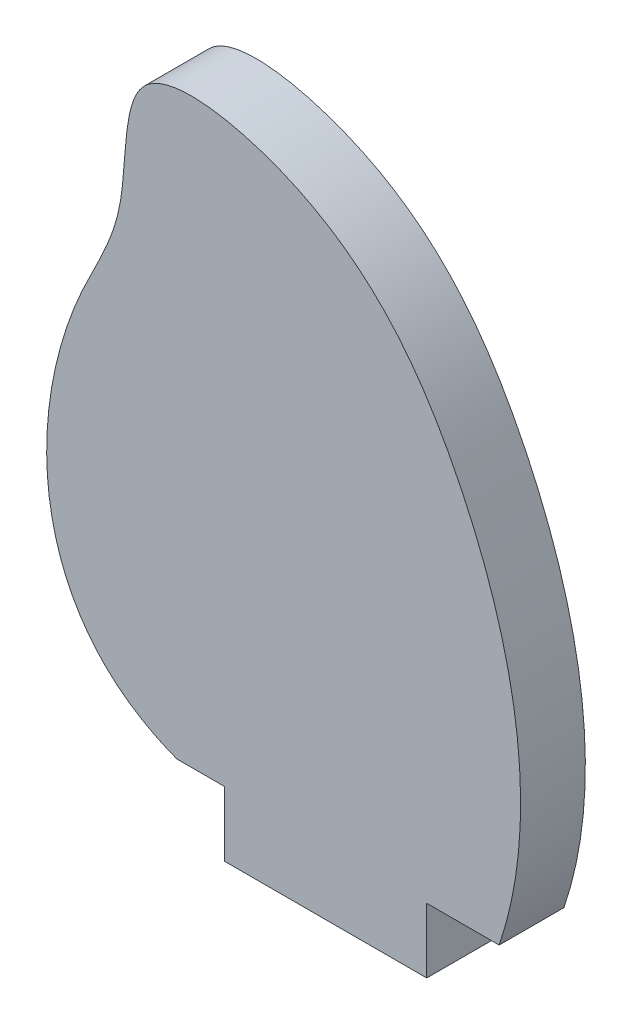
ISO-10303-21;
HEADER;
FILE_DESCRIPTION(('STEP AP214'),'2;1');
FILE_NAME('part.step','',(''),(''),'','','');
FILE_SCHEMA(('AUTOMOTIVE_DESIGN { 1 0 10303 214 1 1 1 1 }'));
ENDSEC;
DATA;
#1=APPLICATION_CONTEXT('core data for automotive mechanical design processes');
#2=APPLICATION_PROTOCOL_DEFINITION('international standard','automotive_design',2000,#1);
#3=PRODUCT_CONTEXT('',#1,'mechanical');
#4=PRODUCT('Part','Part','',(#3));
#5=PRODUCT_RELATED_PRODUCT_CATEGORY('part','',(#4));
#6=PRODUCT_DEFINITION_FORMATION('','',#4);
#7=PRODUCT_DEFINITION_CONTEXT('part definition',#1,'design');
#8=PRODUCT_DEFINITION('design','',#6,#7);
#9=PRODUCT_DEFINITION_SHAPE('','',#8);
#10=(LENGTH_UNIT() NAMED_UNIT(*) SI_UNIT(.MILLI.,.METRE.));
#11=(NAMED_UNIT(*) PLANE_ANGLE_UNIT() SI_UNIT($,.RADIAN.));
#12=(NAMED_UNIT(*) SI_UNIT($,.STERADIAN.) SOLID_ANGLE_UNIT());
#13=UNCERTAINTY_MEASURE_WITH_UNIT(LENGTH_MEASURE(1.E-05),#10,'distance_accuracy_value','');
#14=(GEOMETRIC_REPRESENTATION_CONTEXT(3) GLOBAL_UNCERTAINTY_ASSIGNED_CONTEXT((#13)) GLOBAL_UNIT_ASSIGNED_CONTEXT((#10,
#11,#12)) REPRESENTATION_CONTEXT('',''));
#15=CARTESIAN_POINT('',(0.,0.,0.));
#16=DIRECTION('',(0.,0.,1.));
#17=DIRECTION('',(1.,0.,0.));
#18=AXIS2_PLACEMENT_3D('',#15,#16,#17);
#19=CARTESIAN_POINT('',(0.,-3.2,3.2));
#20=DIRECTION('',(1.,0.,0.));
#21=DIRECTION('',(0.,0.,-1.));
#22=AXIS2_PLACEMENT_3D('',#19,#20,#21);
#23=PLANE('',#22);
#24=DIRECTION('',(0.,-1.,0.));
#25=VECTOR('',#24,1.);
#26=CARTESIAN_POINT('',(0.,-3.2,0.));
#27=LINE('',#26,#25);
#28=CARTESIAN_POINT('',(0.,0.,0.));
#29=VERTEX_POINT('',#28);
#30=CARTESIAN_POINT('',(0.,-3.2,0.));
#31=VERTEX_POINT('',#30);
#32=EDGE_CURVE('E147',#29,#31,#27,.T.);
#33=ORIENTED_EDGE('',*,*,#32,.T.);
#34=DIRECTION('',(0.,0.,-1.));
#35=VECTOR('',#34,1.);
#36=CARTESIAN_POINT('',(0.,-3.2,3.2));
#37=LINE('',#36,#35);
#38=CARTESIAN_POINT('',(0.,-3.2,3.2));
#39=VERTEX_POINT('',#38);
#40=EDGE_CURVE('E11',#39,#31,#37,.T.);
#41=ORIENTED_EDGE('',*,*,#40,.F.);
#42=DIRECTION('',(0.,-1.,0.));
#43=VECTOR('',#42,1.);
#44=CARTESIAN_POINT('',(0.,-3.2,3.2));
#45=LINE('',#44,#43);
#46=CARTESIAN_POINT('',(0.,0.,3.2));
#47=VERTEX_POINT('',#46);
#48=EDGE_CURVE('E160',#47,#39,#45,.T.);
#49=ORIENTED_EDGE('',*,*,#48,.F.);
#50=DIRECTION('',(0.,0.,-1.));
#51=VECTOR('',#50,1.);
#52=CARTESIAN_POINT('',(0.,0.,3.2));
#53=LINE('',#52,#51);
#54=EDGE_CURVE('E112',#47,#29,#53,.T.);
#55=ORIENTED_EDGE('',*,*,#54,.T.);
#56=EDGE_LOOP('',(#33,#41,#49,#55));
#57=FACE_BOUND('',#56,.T.);
#58=ADVANCED_FACE('F32',(#57),#23,.F.);
#59=CARTESIAN_POINT('',(10.,-3.2,3.2));
#60=DIRECTION('',(0.,1.,0.));
#61=DIRECTION('',(-1.,0.,0.));
#62=AXIS2_PLACEMENT_3D('',#59,#60,#61);
#63=PLANE('',#62);
#64=DIRECTION('',(1.,0.,0.));
#65=VECTOR('',#64,1.);
#66=CARTESIAN_POINT('',(10.,-3.2,0.));
#67=LINE('',#66,#65);
#68=CARTESIAN_POINT('',(10.,-3.2,0.));
#69=VERTEX_POINT('',#68);
#70=EDGE_CURVE('E139',#31,#69,#67,.T.);
#71=ORIENTED_EDGE('',*,*,#70,.T.);
#72=DIRECTION('',(0.,0.,-1.));
#73=VECTOR('',#72,1.);
#74=CARTESIAN_POINT('',(10.,-3.2,3.2));
#75=LINE('',#74,#73);
#76=CARTESIAN_POINT('',(10.,-3.2,3.2));
#77=VERTEX_POINT('',#76);
#78=EDGE_CURVE('E40',#77,#69,#75,.T.);
#79=ORIENTED_EDGE('',*,*,#78,.F.);
#80=DIRECTION('',(1.,0.,0.));
#81=VECTOR('',#80,1.);
#82=CARTESIAN_POINT('',(10.,-3.2,3.2));
#83=LINE('',#82,#81);
#84=EDGE_CURVE('E85',#39,#77,#83,.T.);
#85=ORIENTED_EDGE('',*,*,#84,.F.);
#86=ORIENTED_EDGE('',*,*,#40,.T.);
#87=EDGE_LOOP('',(#71,#79,#85,#86));
#88=FACE_BOUND('',#87,.T.);
#89=ADVANCED_FACE('F132',(#88),#63,.F.);
#90=CARTESIAN_POINT('',(10.,0.,3.2));
#91=DIRECTION('',(-1.,0.,0.));
#92=DIRECTION('',(0.,-1.,0.));
#93=AXIS2_PLACEMENT_3D('',#90,#91,#92);
#94=PLANE('',#93);
#95=DIRECTION('',(0.,1.,0.));
#96=VECTOR('',#95,1.);
#97=CARTESIAN_POINT('',(10.,0.,0.));
#98=LINE('',#97,#96);
#99=CARTESIAN_POINT('',(10.,0.,0.));
#100=VERTEX_POINT('',#99);
#101=EDGE_CURVE('E146',#69,#100,#98,.T.);
#102=ORIENTED_EDGE('',*,*,#101,.T.);
#103=DIRECTION('',(0.,0.,-1.));
#104=VECTOR('',#103,1.);
#105=CARTESIAN_POINT('',(10.,0.,3.2));
#106=LINE('',#105,#104);
#107=CARTESIAN_POINT('',(10.,0.,3.2));
#108=VERTEX_POINT('',#107);
#109=EDGE_CURVE('E107',#108,#100,#106,.T.);
#110=ORIENTED_EDGE('',*,*,#109,.F.);
#111=DIRECTION('',(0.,1.,0.));
#112=VECTOR('',#111,1.);
#113=CARTESIAN_POINT('',(10.,0.,3.2));
#114=LINE('',#113,#112);
#115=EDGE_CURVE('E98',#77,#108,#114,.T.);
#116=ORIENTED_EDGE('',*,*,#115,.F.);
#117=ORIENTED_EDGE('',*,*,#78,.T.);
#118=EDGE_LOOP('',(#102,#110,#116,#117));
#119=FACE_BOUND('',#118,.T.);
#120=ADVANCED_FACE('F130',(#119),#94,.F.);
#121=CARTESIAN_POINT('',(13.580872951471,0.,3.2));
#122=DIRECTION('',(0.,1.,0.));
#123=DIRECTION('',(0.,0.,1.));
#124=AXIS2_PLACEMENT_3D('',#121,#122,#123);
#125=PLANE('',#124);
#126=DIRECTION('',(1.,0.,0.));
#127=VECTOR('',#126,1.);
#128=CARTESIAN_POINT('',(13.580872951471,0.,0.));
#129=LINE('',#128,#127);
#130=CARTESIAN_POINT('',(13.580872951471,0.,0.));
#131=VERTEX_POINT('',#130);
#132=EDGE_CURVE('E106',#100,#131,#129,.T.);
#133=ORIENTED_EDGE('',*,*,#132,.T.);
#134=DIRECTION('',(0.,0.,-1.));
#135=VECTOR('',#134,1.);
#136=CARTESIAN_POINT('',(13.580872951471,0.,3.2));
#137=LINE('',#136,#135);
#138=CARTESIAN_POINT('',(13.580872951471,0.,3.2));
#139=VERTEX_POINT('',#138);
#140=EDGE_CURVE('E103',#139,#131,#137,.T.);
#141=ORIENTED_EDGE('',*,*,#140,.F.);
#142=DIRECTION('',(1.,0.,0.));
#143=VECTOR('',#142,1.);
#144=CARTESIAN_POINT('',(13.580872951471,0.,3.2));
#145=LINE('',#144,#143);
#146=EDGE_CURVE('E92',#108,#139,#145,.T.);
#147=ORIENTED_EDGE('',*,*,#146,.F.);
#148=ORIENTED_EDGE('',*,*,#109,.T.);
#149=EDGE_LOOP('',(#133,#141,#147,#148));
#150=FACE_BOUND('',#149,.T.);
#151=ADVANCED_FACE('F104',(#150),#125,.F.);
#152=CARTESIAN_POINT('',(13.580872951471,0.,3.2));
#153=CARTESIAN_POINT('',(15.7685212883346,6.46025766467819,3.2));
#154=CARTESIAN_POINT('',(13.4854880924469,17.7672206596233,3.2));
#155=CARTESIAN_POINT('',(5.69496997661889,27.8152858998178,3.2));
#156=CARTESIAN_POINT('',(-5.43381176208158,29.7169988949278,3.2));
#157=CARTESIAN_POINT('',(-4.52653246426529,22.1224631837265,3.2));
#158=CARTESIAN_POINT('',(-9.79313047797735,13.6700521794642,3.2));
#159=CARTESIAN_POINT('',(-9.96485436740551,2.86721973566685,3.2));
#160=CARTESIAN_POINT('',(-2.34817673801757,0.,3.2));
#161=B_SPLINE_CURVE_WITH_KNOTS('',3,(#152,#153,#154,#155,#156,#157,#158,#159,#160),
.UNSPECIFIED.,.F.,.F.,(4,1,1,1,1,1,4),(0.,0.285949787772885,0.460553567111202,0.555633519089957,
0.640885494898914,0.71018893355548,1.),.UNSPECIFIED.);
#162=DIRECTION('',(0.,0.,-1.));
#163=VECTOR('',#162,1.);
#164=SURFACE_OF_LINEAR_EXTRUSION('',#161,#163);
#165=CARTESIAN_POINT('',(13.580872951471,0.,0.));
#166=CARTESIAN_POINT('',(15.7685212883346,6.46025766467819,0.));
#167=CARTESIAN_POINT('',(13.4854880924469,17.7672206596233,0.));
#168=CARTESIAN_POINT('',(5.69496997661889,27.8152858998178,0.));
#169=CARTESIAN_POINT('',(-5.43381176208158,29.7169988949278,0.));
#170=CARTESIAN_POINT('',(-4.52653246426529,22.1224631837265,0.));
#171=CARTESIAN_POINT('',(-9.79313047797735,13.6700521794642,0.));
#172=CARTESIAN_POINT('',(-9.96485436740551,2.86721973566685,0.));
#173=CARTESIAN_POINT('',(-2.34817673801757,0.,0.));
#174=B_SPLINE_CURVE_WITH_KNOTS('',3,(#165,#166,#167,#168,#169,#170,#171,#172,#173),
.UNSPECIFIED.,.F.,.F.,(4,1,1,1,1,1,4),(0.,0.285949787772885,0.460553567111202,0.555633519089957,
0.640885494898914,0.71018893355548,1.),.UNSPECIFIED.);
#175=CARTESIAN_POINT('',(-2.34817673801757,0.,0.));
#176=VERTEX_POINT('',#175);
#177=EDGE_CURVE('E71',#131,#176,#174,.T.);
#178=ORIENTED_EDGE('',*,*,#177,.T.);
#179=DIRECTION('',(0.,0.,-1.));
#180=VECTOR('',#179,1.);
#181=CARTESIAN_POINT('',(-2.34817673801757,0.,3.2));
#182=LINE('',#181,#180);
#183=CARTESIAN_POINT('',(-2.34817673801757,0.,3.2));
#184=VERTEX_POINT('',#183);
#185=EDGE_CURVE('E108',#184,#176,#182,.T.);
#186=ORIENTED_EDGE('',*,*,#185,.F.);
#187=EDGE_CURVE('E96',#139,#184,#161,.T.);
#188=ORIENTED_EDGE('',*,*,#187,.F.);
#189=ORIENTED_EDGE('',*,*,#140,.T.);
#190=EDGE_LOOP('',(#178,#186,#188,#189));
#191=FACE_BOUND('',#190,.T.);
#192=ADVANCED_FACE('F110',(#191),#164,.F.);
#193=CARTESIAN_POINT('',(0.,0.,3.2));
#194=DIRECTION('',(0.,1.,0.));
#195=DIRECTION('',(0.,0.,1.));
#196=AXIS2_PLACEMENT_3D('',#193,#194,#195);
#197=PLANE('',#196);
#198=DIRECTION('',(1.,0.,0.));
#199=VECTOR('',#198,1.);
#200=CARTESIAN_POINT('',(0.,0.,0.));
#201=LINE('',#200,#199);
#202=EDGE_CURVE('E77',#176,#29,#201,.T.);
#203=ORIENTED_EDGE('',*,*,#202,.T.);
#204=ORIENTED_EDGE('',*,*,#54,.F.);
#205=DIRECTION('',(1.,0.,0.));
#206=VECTOR('',#205,1.);
#207=CARTESIAN_POINT('',(0.,0.,3.2));
#208=LINE('',#207,#206);
#209=EDGE_CURVE('E48',#184,#47,#208,.T.);
#210=ORIENTED_EDGE('',*,*,#209,.F.);
#211=ORIENTED_EDGE('',*,*,#185,.T.);
#212=EDGE_LOOP('',(#203,#204,#210,#211));
#213=FACE_BOUND('',#212,.T.);
#214=ADVANCED_FACE('F126',(#213),#197,.F.);
#215=CARTESIAN_POINT('',(-0.500047014854389,28.6618713131805,3.2));
#216=DIRECTION('',(0.,0.,1.));
#217=DIRECTION('',(1.,0.,0.));
#218=AXIS2_PLACEMENT_3D('',#215,#216,#217);
#219=PLANE('',#218);
#220=ORIENTED_EDGE('',*,*,#48,.T.);
#221=ORIENTED_EDGE('',*,*,#84,.T.);
#222=ORIENTED_EDGE('',*,*,#115,.T.);
#223=ORIENTED_EDGE('',*,*,#146,.T.);
#224=ORIENTED_EDGE('',*,*,#187,.T.);
#225=ORIENTED_EDGE('',*,*,#209,.T.);
#226=EDGE_LOOP('',(#220,#221,#222,#223,#224,#225));
#227=FACE_BOUND('',#226,.T.);
#228=ADVANCED_FACE('F94',(#227),#219,.T.);
#229=CARTESIAN_POINT('',(-0.500047014854389,28.6618713131805,0.));
#230=DIRECTION('',(0.,0.,1.));
#231=DIRECTION('',(1.,0.,0.));
#232=AXIS2_PLACEMENT_3D('',#229,#230,#231);
#233=PLANE('',#232);
#234=ORIENTED_EDGE('',*,*,#32,.F.);
#235=ORIENTED_EDGE('',*,*,#202,.F.);
#236=ORIENTED_EDGE('',*,*,#177,.F.);
#237=ORIENTED_EDGE('',*,*,#132,.F.);
#238=ORIENTED_EDGE('',*,*,#101,.F.);
#239=ORIENTED_EDGE('',*,*,#70,.F.);
#240=EDGE_LOOP('',(#234,#235,#236,#237,#238,#239));
#241=FACE_BOUND('',#240,.T.);
#242=ADVANCED_FACE('F149',(#241),#233,.F.);
#243=CLOSED_SHELL('',(#58,#89,#120,#151,#192,#214,#228,#242));
#244=MANIFOLD_SOLID_BREP('B2',#243);
#245=ADVANCED_BREP_SHAPE_REPRESENTATION('',(#18,#244),#14);
#246=SHAPE_DEFINITION_REPRESENTATION(#9,#245);
ENDSEC;
END-ISO-10303-21;
